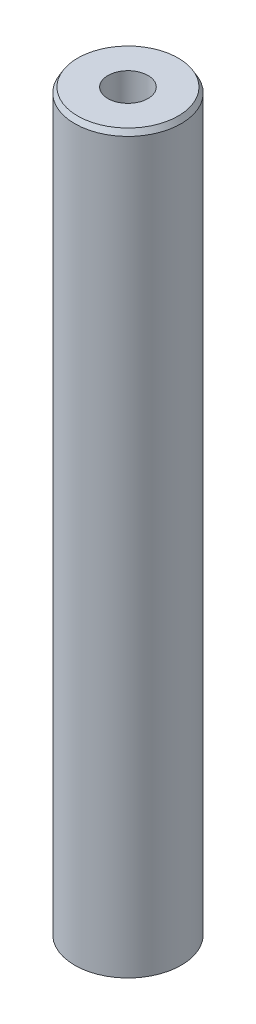
ISO-10303-21;
HEADER;
FILE_DESCRIPTION(('STEP AP214'),'2;1');
FILE_NAME('part.step','',(''),(''),'','','');
FILE_SCHEMA(('AUTOMOTIVE_DESIGN { 1 0 10303 214 1 1 1 1 }'));
ENDSEC;
DATA;
#1=APPLICATION_CONTEXT('core data for automotive mechanical design processes');
#2=APPLICATION_PROTOCOL_DEFINITION('international standard','automotive_design',2000,#1);
#3=PRODUCT_CONTEXT('',#1,'mechanical');
#4=PRODUCT('Part','Part','',(#3));
#5=PRODUCT_RELATED_PRODUCT_CATEGORY('part','',(#4));
#6=PRODUCT_DEFINITION_FORMATION('','',#4);
#7=PRODUCT_DEFINITION_CONTEXT('part definition',#1,'design');
#8=PRODUCT_DEFINITION('design','',#6,#7);
#9=PRODUCT_DEFINITION_SHAPE('','',#8);
#10=(LENGTH_UNIT() NAMED_UNIT(*) SI_UNIT(.MILLI.,.METRE.));
#11=(NAMED_UNIT(*) PLANE_ANGLE_UNIT() SI_UNIT($,.RADIAN.));
#12=(NAMED_UNIT(*) SI_UNIT($,.STERADIAN.) SOLID_ANGLE_UNIT());
#13=UNCERTAINTY_MEASURE_WITH_UNIT(LENGTH_MEASURE(1.E-05),#10,'distance_accuracy_value','');
#14=(GEOMETRIC_REPRESENTATION_CONTEXT(3) GLOBAL_UNCERTAINTY_ASSIGNED_CONTEXT((#13)) GLOBAL_UNIT_ASSIGNED_CONTEXT((#10,
#11,#12)) REPRESENTATION_CONTEXT('',''));
#15=CARTESIAN_POINT('',(0.,0.,0.));
#16=DIRECTION('',(0.,0.,1.));
#17=DIRECTION('',(1.,0.,0.));
#18=AXIS2_PLACEMENT_3D('',#15,#16,#17);
#19=CARTESIAN_POINT('',(0.,103.863629812319,0.));
#20=DIRECTION('',(0.,-1.,0.));
#21=DIRECTION('',(0.,0.,-1.));
#22=AXIS2_PLACEMENT_3D('',#19,#20,#21);
#23=CYLINDRICAL_SURFACE('',#22,7.5);
#24=CARTESIAN_POINT('',(0.,103.137946930268,0.));
#25=DIRECTION('',(0.,1.,0.));
#26=DIRECTION('',(0.,0.,1.));
#27=AXIS2_PLACEMENT_3D('',#24,#25,#26);
#28=CIRCLE('',#27,7.5);
#29=CARTESIAN_POINT('',(0.,103.137946930268,7.5));
#30=VERTEX_POINT('',#29);
#31=EDGE_CURVE('E50',#30,#30,#28,.F.);
#32=ORIENTED_EDGE('',*,*,#31,.T.);
#33=EDGE_LOOP('',(#32));
#34=FACE_BOUND('',#33,.T.);
#35=CARTESIAN_POINT('',(0.,0.418973207298376,0.));
#36=DIRECTION('',(0.,1.,0.));
#37=DIRECTION('',(0.,0.,1.));
#38=AXIS2_PLACEMENT_3D('',#35,#36,#37);
#39=CIRCLE('',#38,7.5);
#40=CARTESIAN_POINT('',(0.,0.418973207298376,7.5));
#41=VERTEX_POINT('',#40);
#42=EDGE_CURVE('E51',#41,#41,#39,.T.);
#43=ORIENTED_EDGE('',*,*,#42,.T.);
#44=EDGE_LOOP('',(#43));
#45=FACE_BOUND('',#44,.T.);
#46=ADVANCED_FACE('F39',(#34,#45),#23,.T.);
#47=CARTESIAN_POINT('',(0.,103.863629812319,0.));
#48=DIRECTION('',(0.,1.,0.));
#49=DIRECTION('',(0.,0.,1.));
#50=AXIS2_PLACEMENT_3D('',#47,#48,#49);
#51=PLANE('',#50);
#52=CARTESIAN_POINT('',(0.,103.863629812319,0.));
#53=DIRECTION('',(0.,1.,0.));
#54=DIRECTION('',(0.,0.,1.));
#55=AXIS2_PLACEMENT_3D('',#52,#53,#54);
#56=CIRCLE('',#55,7.08102679270163);
#57=CARTESIAN_POINT('',(0.,103.863629812319,7.08102679270163));
#58=VERTEX_POINT('',#57);
#59=EDGE_CURVE('E54',#58,#58,#56,.T.);
#60=ORIENTED_EDGE('',*,*,#59,.T.);
#61=EDGE_LOOP('',(#60));
#62=FACE_BOUND('',#61,.T.);
#63=CARTESIAN_POINT('',(0.,103.863629812319,0.));
#64=DIRECTION('',(0.,1.,0.));
#65=DIRECTION('',(0.,0.,1.));
#66=AXIS2_PLACEMENT_3D('',#63,#64,#65);
#67=CIRCLE('',#66,2.82395541086376);
#68=CARTESIAN_POINT('',(0.,103.863629812319,2.82395541086376));
#69=VERTEX_POINT('',#68);
#70=EDGE_CURVE('E58',#69,#69,#67,.T.);
#71=ORIENTED_EDGE('',*,*,#70,.F.);
#72=EDGE_LOOP('',(#71));
#73=FACE_BOUND('',#72,.T.);
#74=ADVANCED_FACE('F69',(#62,#73),#51,.T.);
#75=CARTESIAN_POINT('',(0.,0.,0.));
#76=DIRECTION('',(0.,1.,0.));
#77=DIRECTION('',(0.,0.,1.));
#78=AXIS2_PLACEMENT_3D('',#75,#76,#77);
#79=PLANE('',#78);
#80=CARTESIAN_POINT('',(0.,0.,0.));
#81=DIRECTION('',(0.,1.,0.));
#82=DIRECTION('',(0.,0.,1.));
#83=AXIS2_PLACEMENT_3D('',#80,#81,#82);
#84=CIRCLE('',#83,6.77431711794914);
#85=CARTESIAN_POINT('',(0.,0.,6.77431711794914));
#86=VERTEX_POINT('',#85);
#87=EDGE_CURVE('E10',#86,#86,#84,.F.);
#88=ORIENTED_EDGE('',*,*,#87,.T.);
#89=EDGE_LOOP('',(#88));
#90=FACE_BOUND('',#89,.T.);
#91=CARTESIAN_POINT('',(0.,0.,0.));
#92=DIRECTION('',(0.,1.,0.));
#93=DIRECTION('',(0.,0.,1.));
#94=AXIS2_PLACEMENT_3D('',#91,#92,#93);
#95=CIRCLE('',#94,2.82395541086376);
#96=CARTESIAN_POINT('',(0.,0.,2.82395541086376));
#97=VERTEX_POINT('',#96);
#98=EDGE_CURVE('E63',#97,#97,#95,.T.);
#99=ORIENTED_EDGE('',*,*,#98,.T.);
#100=EDGE_LOOP('',(#99));
#101=FACE_BOUND('',#100,.T.);
#102=ADVANCED_FACE('F75',(#90,#101),#79,.F.);
#103=CARTESIAN_POINT('',(0.,103.863629812319,0.));
#104=DIRECTION('',(0.,-1.,0.));
#105=DIRECTION('',(0.,0.,-1.));
#106=AXIS2_PLACEMENT_3D('',#103,#104,#105);
#107=CYLINDRICAL_SURFACE('',#106,2.82395541086376);
#108=ORIENTED_EDGE('',*,*,#70,.T.);
#109=EDGE_LOOP('',(#108));
#110=FACE_BOUND('',#109,.T.);
#111=ORIENTED_EDGE('',*,*,#98,.F.);
#112=EDGE_LOOP('',(#111));
#113=FACE_BOUND('',#112,.T.);
#114=ADVANCED_FACE('F70',(#110,#113),#107,.F.);
#115=CARTESIAN_POINT('',(0.,103.863629812319,0.));
#116=DIRECTION('',(0.,-1.,0.));
#117=DIRECTION('',(0.,0.,-1.));
#118=AXIS2_PLACEMENT_3D('',#115,#116,#117);
#119=CONICAL_SURFACE('',#118,7.08102679270163,0.523598775598296);
#120=ORIENTED_EDGE('',*,*,#31,.F.);
#121=EDGE_LOOP('',(#120));
#122=FACE_BOUND('',#121,.T.);
#123=ORIENTED_EDGE('',*,*,#59,.F.);
#124=EDGE_LOOP('',(#123));
#125=FACE_BOUND('',#124,.T.);
#126=ADVANCED_FACE('F81',(#122,#125),#119,.T.);
#127=CARTESIAN_POINT('',(0.,0.418973207298376,0.));
#128=DIRECTION('',(0.,1.,0.));
#129=DIRECTION('',(0.,0.,1.));
#130=AXIS2_PLACEMENT_3D('',#127,#128,#129);
#131=CONICAL_SURFACE('',#130,7.5,1.04719755119659);
#132=ORIENTED_EDGE('',*,*,#87,.F.);
#133=EDGE_LOOP('',(#132));
#134=FACE_BOUND('',#133,.T.);
#135=ORIENTED_EDGE('',*,*,#42,.F.);
#136=EDGE_LOOP('',(#135));
#137=FACE_BOUND('',#136,.T.);
#138=ADVANCED_FACE('F45',(#134,#137),#131,.T.);
#139=CLOSED_SHELL('',(#46,#74,#102,#114,#126,#138));
#140=MANIFOLD_SOLID_BREP('B2',#139);
#141=ADVANCED_BREP_SHAPE_REPRESENTATION('',(#18,#140),#14);
#142=SHAPE_DEFINITION_REPRESENTATION(#9,#141);
ENDSEC;
END-ISO-10303-21;
